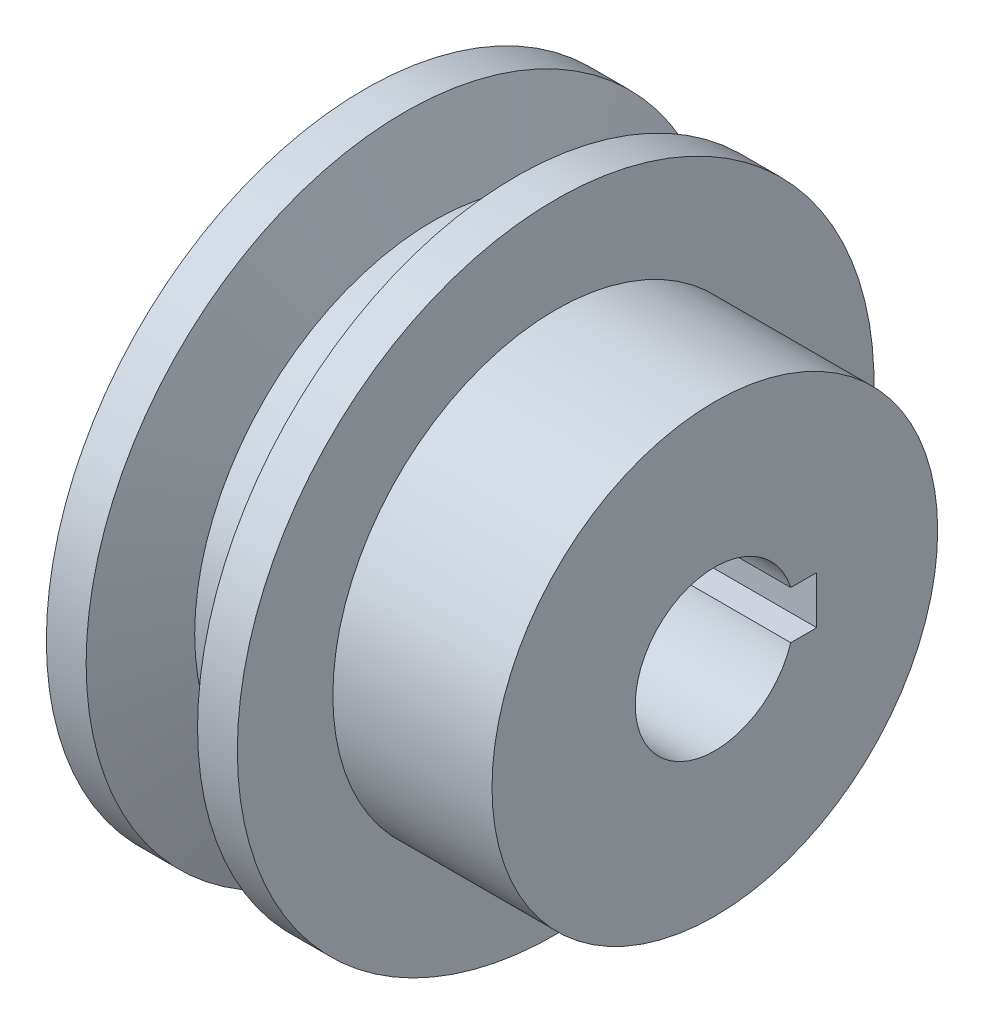
ISO-10303-21;
HEADER;
FILE_DESCRIPTION(('STEP AP214'),'2;1');
FILE_NAME('part.step','',(''),(''),'','','');
FILE_SCHEMA(('AUTOMOTIVE_DESIGN { 1 0 10303 214 1 1 1 1 }'));
ENDSEC;
DATA;
#1=APPLICATION_CONTEXT('core data for automotive mechanical design processes');
#2=APPLICATION_PROTOCOL_DEFINITION('international standard','automotive_design',2000,#1);
#3=PRODUCT_CONTEXT('',#1,'mechanical');
#4=PRODUCT('Part','Part','',(#3));
#5=PRODUCT_RELATED_PRODUCT_CATEGORY('part','',(#4));
#6=PRODUCT_DEFINITION_FORMATION('','',#4);
#7=PRODUCT_DEFINITION_CONTEXT('part definition',#1,'design');
#8=PRODUCT_DEFINITION('design','',#6,#7);
#9=PRODUCT_DEFINITION_SHAPE('','',#8);
#10=(LENGTH_UNIT() NAMED_UNIT(*) SI_UNIT(.MILLI.,.METRE.));
#11=(NAMED_UNIT(*) PLANE_ANGLE_UNIT() SI_UNIT($,.RADIAN.));
#12=(NAMED_UNIT(*) SI_UNIT($,.STERADIAN.) SOLID_ANGLE_UNIT());
#13=UNCERTAINTY_MEASURE_WITH_UNIT(LENGTH_MEASURE(1.E-05),#10,'distance_accuracy_value','');
#14=(GEOMETRIC_REPRESENTATION_CONTEXT(3) GLOBAL_UNCERTAINTY_ASSIGNED_CONTEXT((#13)) GLOBAL_UNIT_ASSIGNED_CONTEXT((#10,
#11,#12)) REPRESENTATION_CONTEXT('',''));
#15=CARTESIAN_POINT('',(0.,0.,0.));
#16=DIRECTION('',(0.,0.,1.));
#17=DIRECTION('',(1.,0.,0.));
#18=AXIS2_PLACEMENT_3D('',#15,#16,#17);
#19=CARTESIAN_POINT('',(-16.5108087351601,0.,0.));
#20=DIRECTION('',(-1.,0.,0.));
#21=DIRECTION('',(0.,0.,1.));
#22=AXIS2_PLACEMENT_3D('',#19,#20,#21);
#23=CYLINDRICAL_SURFACE('',#22,5.);
#24=CARTESIAN_POINT('',(-6.56281793594015,0.,0.));
#25=DIRECTION('',(-1.,0.,0.));
#26=DIRECTION('',(0.,0.,1.));
#27=AXIS2_PLACEMENT_3D('',#24,#25,#26);
#28=CIRCLE('',#27,5.);
#29=CARTESIAN_POINT('',(-6.56281793594015,-1.5,-4.76969600708473));
#30=VERTEX_POINT('',#29);
#31=CARTESIAN_POINT('',(-6.56281793594015,1.5,-4.76969600708473));
#32=VERTEX_POINT('',#31);
#33=EDGE_CURVE('E85',#30,#32,#28,.T.);
#34=ORIENTED_EDGE('',*,*,#33,.T.);
#35=DIRECTION('',(1.,0.,0.));
#36=VECTOR('',#35,1.);
#37=CARTESIAN_POINT('',(-6.56281793594015,1.5,-4.76969600708473));
#38=LINE('',#37,#36);
#39=CARTESIAN_POINT('',(15.4371880640598,1.5,-4.76969600708473));
#40=VERTEX_POINT('',#39);
#41=EDGE_CURVE('E75',#32,#40,#38,.T.);
#42=ORIENTED_EDGE('',*,*,#41,.T.);
#43=CARTESIAN_POINT('',(15.4371820640598,0.,0.));
#44=DIRECTION('',(-1.,0.,0.));
#45=DIRECTION('',(0.,0.,1.));
#46=AXIS2_PLACEMENT_3D('',#43,#44,#45);
#47=CIRCLE('',#46,5.);
#48=CARTESIAN_POINT('',(15.4371820640598,-1.5,-4.76969600708473));
#49=VERTEX_POINT('',#48);
#50=EDGE_CURVE('E83',#49,#40,#47,.T.);
#51=ORIENTED_EDGE('',*,*,#50,.F.);
#52=DIRECTION('',(1.,0.,0.));
#53=VECTOR('',#52,1.);
#54=CARTESIAN_POINT('',(-6.56281793594015,-1.5,-4.76969600708473));
#55=LINE('',#54,#53);
#56=EDGE_CURVE('E48',#30,#49,#55,.T.);
#57=ORIENTED_EDGE('',*,*,#56,.F.);
#58=EDGE_LOOP('',(#34,#42,#51,#57));
#59=FACE_BOUND('',#58,.T.);
#60=ADVANCED_FACE('F33',(#59),#23,.F.);
#61=CARTESIAN_POINT('',(-6.56281793594015,5.,0.));
#62=DIRECTION('',(1.,0.,0.));
#63=DIRECTION('',(0.,0.,-1.));
#64=AXIS2_PLACEMENT_3D('',#61,#62,#63);
#65=PLANE('',#64);
#66=DIRECTION('',(0.,1.,0.));
#67=VECTOR('',#66,1.);
#68=CARTESIAN_POINT('',(-6.56281793594015,-1.5,-6.4));
#69=LINE('',#68,#67);
#70=CARTESIAN_POINT('',(-6.56281793594015,-1.5,-6.4));
#71=VERTEX_POINT('',#70);
#72=CARTESIAN_POINT('',(-6.56281793594015,1.5,-6.4));
#73=VERTEX_POINT('',#72);
#74=EDGE_CURVE('E132',#71,#73,#69,.T.);
#75=ORIENTED_EDGE('',*,*,#74,.T.);
#76=DIRECTION('',(0.,0.,1.));
#77=VECTOR('',#76,1.);
#78=CARTESIAN_POINT('',(-6.56281793594015,1.5,-6.4));
#79=LINE('',#78,#77);
#80=EDGE_CURVE('E126',#73,#32,#79,.T.);
#81=ORIENTED_EDGE('',*,*,#80,.T.);
#82=ORIENTED_EDGE('',*,*,#33,.F.);
#83=DIRECTION('',(0.,0.,-1.));
#84=VECTOR('',#83,1.);
#85=CARTESIAN_POINT('',(-6.56281793594015,-1.5,-4.76969600708473));
#86=LINE('',#85,#84);
#87=EDGE_CURVE('E135',#30,#71,#86,.T.);
#88=ORIENTED_EDGE('',*,*,#87,.T.);
#89=EDGE_LOOP('',(#75,#81,#82,#88));
#90=FACE_BOUND('',#89,.T.);
#91=CARTESIAN_POINT('',(-6.56281793594015,0.,0.));
#92=DIRECTION('',(-1.,0.,0.));
#93=DIRECTION('',(0.,0.,1.));
#94=AXIS2_PLACEMENT_3D('',#91,#92,#93);
#95=CIRCLE('',#94,20.);
#96=CARTESIAN_POINT('',(-6.56281793594015,0.,20.));
#97=VERTEX_POINT('',#96);
#98=EDGE_CURVE('E101',#97,#97,#95,.T.);
#99=ORIENTED_EDGE('',*,*,#98,.T.);
#100=EDGE_LOOP('',(#99));
#101=FACE_BOUND('',#100,.T.);
#102=ADVANCED_FACE('F138',(#90,#101),#65,.F.);
#103=CARTESIAN_POINT('',(-16.5108087351601,0.,0.));
#104=DIRECTION('',(-1.,0.,0.));
#105=DIRECTION('',(0.,0.,1.));
#106=AXIS2_PLACEMENT_3D('',#103,#104,#105);
#107=CYLINDRICAL_SURFACE('',#106,20.);
#108=ORIENTED_EDGE('',*,*,#98,.F.);
#109=EDGE_LOOP('',(#108));
#110=FACE_BOUND('',#109,.T.);
#111=CARTESIAN_POINT('',(-4.06281793594015,0.,0.));
#112=DIRECTION('',(-1.,0.,0.));
#113=DIRECTION('',(0.,0.,1.));
#114=AXIS2_PLACEMENT_3D('',#111,#112,#113);
#115=CIRCLE('',#114,20.);
#116=CARTESIAN_POINT('',(-4.06281793594015,0.,20.));
#117=VERTEX_POINT('',#116);
#118=EDGE_CURVE('E103',#117,#117,#115,.T.);
#119=ORIENTED_EDGE('',*,*,#118,.T.);
#120=EDGE_LOOP('',(#119));
#121=FACE_BOUND('',#120,.T.);
#122=ADVANCED_FACE('F155',(#110,#121),#107,.T.);
#123=CARTESIAN_POINT('',(-2.24296676460916,0.,0.));
#124=DIRECTION('',(-1.,0.,0.));
#125=DIRECTION('',(0.,0.,1.));
#126=AXIS2_PLACEMENT_3D('',#123,#124,#125);
#127=CONICAL_SURFACE('',#126,15.,1.22173047639603);
#128=ORIENTED_EDGE('',*,*,#118,.F.);
#129=EDGE_LOOP('',(#128));
#130=FACE_BOUND('',#129,.T.);
#131=CARTESIAN_POINT('',(-2.24296676460916,0.,0.));
#132=DIRECTION('',(-1.,0.,0.));
#133=DIRECTION('',(0.,0.,1.));
#134=AXIS2_PLACEMENT_3D('',#131,#132,#133);
#135=CIRCLE('',#134,15.);
#136=CARTESIAN_POINT('',(-2.24296676460916,0.,15.));
#137=VERTEX_POINT('',#136);
#138=EDGE_CURVE('E108',#137,#137,#135,.T.);
#139=ORIENTED_EDGE('',*,*,#138,.T.);
#140=EDGE_LOOP('',(#139));
#141=FACE_BOUND('',#140,.T.);
#142=ADVANCED_FACE('F159',(#130,#141),#127,.T.);
#143=CARTESIAN_POINT('',(-16.5108087351601,0.,0.));
#144=DIRECTION('',(-1.,0.,0.));
#145=DIRECTION('',(0.,0.,1.));
#146=AXIS2_PLACEMENT_3D('',#143,#144,#145);
#147=CYLINDRICAL_SURFACE('',#146,15.);
#148=ORIENTED_EDGE('',*,*,#138,.F.);
#149=EDGE_LOOP('',(#148));
#150=FACE_BOUND('',#149,.T.);
#151=CARTESIAN_POINT('',(1.11733089272885,0.,0.));
#152=DIRECTION('',(-1.,0.,0.));
#153=DIRECTION('',(0.,0.,1.));
#154=AXIS2_PLACEMENT_3D('',#151,#152,#153);
#155=CIRCLE('',#154,15.);
#156=CARTESIAN_POINT('',(1.11733089272885,0.,15.));
#157=VERTEX_POINT('',#156);
#158=EDGE_CURVE('E111',#157,#157,#155,.T.);
#159=ORIENTED_EDGE('',*,*,#158,.T.);
#160=EDGE_LOOP('',(#159));
#161=FACE_BOUND('',#160,.T.);
#162=ADVANCED_FACE('F165',(#150,#161),#147,.T.);
#163=CARTESIAN_POINT('',(2.93718206405985,0.,0.));
#164=DIRECTION('',(1.,0.,0.));
#165=DIRECTION('',(0.,0.,-1.));
#166=AXIS2_PLACEMENT_3D('',#163,#164,#165);
#167=CONICAL_SURFACE('',#166,20.,1.22173047639603);
#168=ORIENTED_EDGE('',*,*,#158,.F.);
#169=EDGE_LOOP('',(#168));
#170=FACE_BOUND('',#169,.T.);
#171=CARTESIAN_POINT('',(2.93718206405985,0.,0.));
#172=DIRECTION('',(-1.,0.,0.));
#173=DIRECTION('',(0.,0.,1.));
#174=AXIS2_PLACEMENT_3D('',#171,#172,#173);
#175=CIRCLE('',#174,20.);
#176=CARTESIAN_POINT('',(2.93718206405985,0.,20.));
#177=VERTEX_POINT('',#176);
#178=EDGE_CURVE('E114',#177,#177,#175,.T.);
#179=ORIENTED_EDGE('',*,*,#178,.T.);
#180=EDGE_LOOP('',(#179));
#181=FACE_BOUND('',#180,.T.);
#182=ADVANCED_FACE('F169',(#170,#181),#167,.T.);
#183=CARTESIAN_POINT('',(-16.5108087351601,0.,0.));
#184=DIRECTION('',(-1.,0.,0.));
#185=DIRECTION('',(0.,0.,1.));
#186=AXIS2_PLACEMENT_3D('',#183,#184,#185);
#187=CYLINDRICAL_SURFACE('',#186,20.);
#188=ORIENTED_EDGE('',*,*,#178,.F.);
#189=EDGE_LOOP('',(#188));
#190=FACE_BOUND('',#189,.T.);
#191=CARTESIAN_POINT('',(5.43718206405985,0.,0.));
#192=DIRECTION('',(-1.,0.,0.));
#193=DIRECTION('',(0.,0.,1.));
#194=AXIS2_PLACEMENT_3D('',#191,#192,#193);
#195=CIRCLE('',#194,20.);
#196=CARTESIAN_POINT('',(5.43718206405985,0.,20.));
#197=VERTEX_POINT('',#196);
#198=EDGE_CURVE('E117',#197,#197,#195,.T.);
#199=ORIENTED_EDGE('',*,*,#198,.T.);
#200=EDGE_LOOP('',(#199));
#201=FACE_BOUND('',#200,.T.);
#202=ADVANCED_FACE('F173',(#190,#201),#187,.T.);
#203=CARTESIAN_POINT('',(5.43718206405985,20.,0.));
#204=DIRECTION('',(-1.,0.,0.));
#205=DIRECTION('',(0.,0.,1.));
#206=AXIS2_PLACEMENT_3D('',#203,#204,#205);
#207=PLANE('',#206);
#208=ORIENTED_EDGE('',*,*,#198,.F.);
#209=EDGE_LOOP('',(#208));
#210=FACE_BOUND('',#209,.T.);
#211=CARTESIAN_POINT('',(5.43718206405985,0.,0.));
#212=DIRECTION('',(-1.,0.,0.));
#213=DIRECTION('',(0.,0.,1.));
#214=AXIS2_PLACEMENT_3D('',#211,#212,#213);
#215=CIRCLE('',#214,14.);
#216=CARTESIAN_POINT('',(5.43718206405985,0.,14.));
#217=VERTEX_POINT('',#216);
#218=EDGE_CURVE('E92',#217,#217,#215,.T.);
#219=ORIENTED_EDGE('',*,*,#218,.T.);
#220=EDGE_LOOP('',(#219));
#221=FACE_BOUND('',#220,.T.);
#222=ADVANCED_FACE('F177',(#210,#221),#207,.F.);
#223=CARTESIAN_POINT('',(-16.5108087351601,0.,0.));
#224=DIRECTION('',(-1.,0.,0.));
#225=DIRECTION('',(0.,0.,1.));
#226=AXIS2_PLACEMENT_3D('',#223,#224,#225);
#227=CYLINDRICAL_SURFACE('',#226,14.);
#228=ORIENTED_EDGE('',*,*,#218,.F.);
#229=EDGE_LOOP('',(#228));
#230=FACE_BOUND('',#229,.T.);
#231=CARTESIAN_POINT('',(15.4371820640598,0.,0.));
#232=DIRECTION('',(-1.,0.,0.));
#233=DIRECTION('',(0.,0.,1.));
#234=AXIS2_PLACEMENT_3D('',#231,#232,#233);
#235=CIRCLE('',#234,14.);
#236=CARTESIAN_POINT('',(15.4371820640598,0.,14.));
#237=VERTEX_POINT('',#236);
#238=EDGE_CURVE('E89',#237,#237,#235,.T.);
#239=ORIENTED_EDGE('',*,*,#238,.T.);
#240=EDGE_LOOP('',(#239));
#241=FACE_BOUND('',#240,.T.);
#242=ADVANCED_FACE('F181',(#230,#241),#227,.T.);
#243=CARTESIAN_POINT('',(15.4371820640598,14.,0.));
#244=DIRECTION('',(-1.,0.,0.));
#245=DIRECTION('',(0.,0.,1.));
#246=AXIS2_PLACEMENT_3D('',#243,#244,#245);
#247=PLANE('',#246);
#248=ORIENTED_EDGE('',*,*,#238,.F.);
#249=EDGE_LOOP('',(#248));
#250=FACE_BOUND('',#249,.T.);
#251=ORIENTED_EDGE('',*,*,#50,.T.);
#252=DIRECTION('',(0.,0.,-1.));
#253=VECTOR('',#252,1.);
#254=CARTESIAN_POINT('',(15.4371820640598,1.5,0.));
#255=LINE('',#254,#253);
#256=CARTESIAN_POINT('',(15.4371820640598,1.5,-6.4));
#257=VERTEX_POINT('',#256);
#258=EDGE_CURVE('E11',#40,#257,#255,.T.);
#259=ORIENTED_EDGE('',*,*,#258,.T.);
#260=DIRECTION('',(0.,-1.,0.));
#261=VECTOR('',#260,1.);
#262=CARTESIAN_POINT('',(15.4371820640598,14.,-6.4));
#263=LINE('',#262,#261);
#264=CARTESIAN_POINT('',(15.4371820640598,-1.5,-6.4));
#265=VERTEX_POINT('',#264);
#266=EDGE_CURVE('E41',#257,#265,#263,.T.);
#267=ORIENTED_EDGE('',*,*,#266,.T.);
#268=DIRECTION('',(0.,0.,1.));
#269=VECTOR('',#268,1.);
#270=CARTESIAN_POINT('',(15.4371820640598,-1.5,0.));
#271=LINE('',#270,#269);
#272=EDGE_CURVE('E88',#265,#49,#271,.T.);
#273=ORIENTED_EDGE('',*,*,#272,.T.);
#274=EDGE_LOOP('',(#251,#259,#267,#273));
#275=FACE_BOUND('',#274,.T.);
#276=ADVANCED_FACE('F87',(#250,#275),#247,.F.);
#277=CARTESIAN_POINT('',(-6.56281793594015,1.5,-6.4));
#278=DIRECTION('',(0.,1.,0.));
#279=DIRECTION('',(0.,0.,1.));
#280=AXIS2_PLACEMENT_3D('',#277,#278,#279);
#281=PLANE('',#280);
#282=ORIENTED_EDGE('',*,*,#41,.F.);
#283=ORIENTED_EDGE('',*,*,#80,.F.);
#284=DIRECTION('',(1.,0.,0.));
#285=VECTOR('',#284,1.);
#286=CARTESIAN_POINT('',(-6.56281793594015,1.5,-6.4));
#287=LINE('',#286,#285);
#288=EDGE_CURVE('E77',#73,#257,#287,.T.);
#289=ORIENTED_EDGE('',*,*,#288,.T.);
#290=ORIENTED_EDGE('',*,*,#258,.F.);
#291=EDGE_LOOP('',(#282,#283,#289,#290));
#292=FACE_BOUND('',#291,.T.);
#293=ADVANCED_FACE('F73',(#292),#281,.F.);
#294=CARTESIAN_POINT('',(-6.56281793594015,-1.5,-6.4));
#295=DIRECTION('',(0.,0.,-1.));
#296=DIRECTION('',(-1.,0.,0.));
#297=AXIS2_PLACEMENT_3D('',#294,#295,#296);
#298=PLANE('',#297);
#299=ORIENTED_EDGE('',*,*,#288,.F.);
#300=ORIENTED_EDGE('',*,*,#74,.F.);
#301=DIRECTION('',(1.,0.,0.));
#302=VECTOR('',#301,1.);
#303=CARTESIAN_POINT('',(-6.56281793594015,-1.5,-6.4));
#304=LINE('',#303,#302);
#305=EDGE_CURVE('E125',#71,#265,#304,.T.);
#306=ORIENTED_EDGE('',*,*,#305,.T.);
#307=ORIENTED_EDGE('',*,*,#266,.F.);
#308=EDGE_LOOP('',(#299,#300,#306,#307));
#309=FACE_BOUND('',#308,.T.);
#310=ADVANCED_FACE('F142',(#309),#298,.F.);
#311=CARTESIAN_POINT('',(-6.56281793594015,-1.5,-4.76969600708473));
#312=DIRECTION('',(0.,-1.,0.));
#313=DIRECTION('',(0.,0.,-1.));
#314=AXIS2_PLACEMENT_3D('',#311,#312,#313);
#315=PLANE('',#314);
#316=ORIENTED_EDGE('',*,*,#305,.F.);
#317=ORIENTED_EDGE('',*,*,#87,.F.);
#318=ORIENTED_EDGE('',*,*,#56,.T.);
#319=ORIENTED_EDGE('',*,*,#272,.F.);
#320=EDGE_LOOP('',(#316,#317,#318,#319));
#321=FACE_BOUND('',#320,.T.);
#322=ADVANCED_FACE('F141',(#321),#315,.F.);
#323=CLOSED_SHELL('',(#60,#102,#122,#142,#162,#182,#202,#222,#242,#276,#293,#310,#322));
#324=MANIFOLD_SOLID_BREP('B2',#323);
#325=ADVANCED_BREP_SHAPE_REPRESENTATION('',(#18,#324),#14);
#326=SHAPE_DEFINITION_REPRESENTATION(#9,#325);
ENDSEC;
END-ISO-10303-21;
